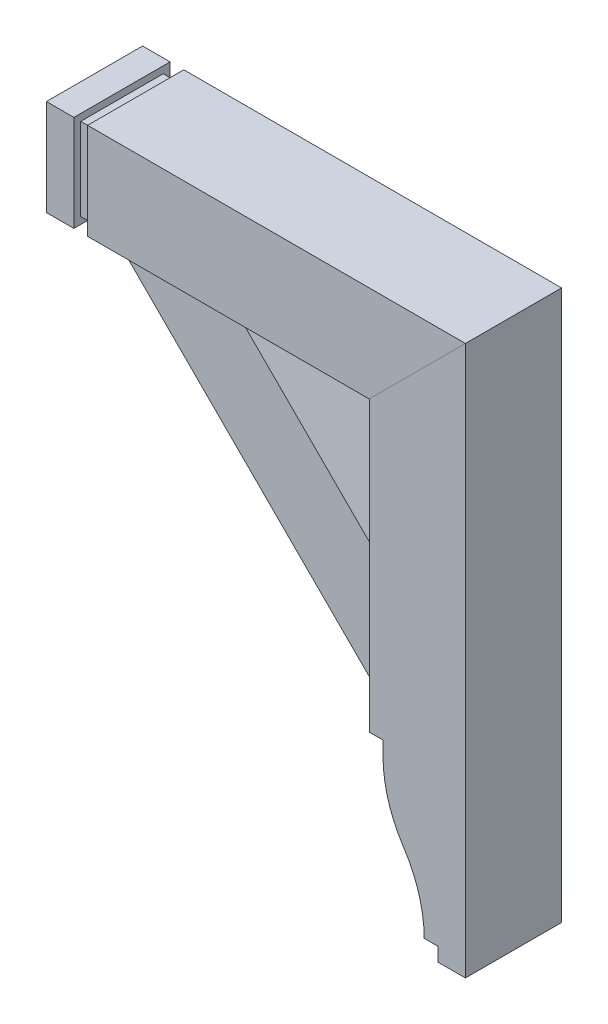
ISO-10303-21;
HEADER;
FILE_DESCRIPTION(('STEP AP214'),'2;1');
FILE_NAME('part.step','',(''),(''),'','','');
FILE_SCHEMA(('AUTOMOTIVE_DESIGN { 1 0 10303 214 1 1 1 1 }'));
ENDSEC;
DATA;
#1=APPLICATION_CONTEXT('core data for automotive mechanical design processes');
#2=APPLICATION_PROTOCOL_DEFINITION('international standard','automotive_design',2000,#1);
#3=PRODUCT_CONTEXT('',#1,'mechanical');
#4=PRODUCT('Part','Part','',(#3));
#5=PRODUCT_RELATED_PRODUCT_CATEGORY('part','',(#4));
#6=PRODUCT_DEFINITION_FORMATION('','',#4);
#7=PRODUCT_DEFINITION_CONTEXT('part definition',#1,'design');
#8=PRODUCT_DEFINITION('design','',#6,#7);
#9=PRODUCT_DEFINITION_SHAPE('','',#8);
#10=(LENGTH_UNIT() NAMED_UNIT(*) SI_UNIT(.MILLI.,.METRE.));
#11=(NAMED_UNIT(*) PLANE_ANGLE_UNIT() SI_UNIT($,.RADIAN.));
#12=(NAMED_UNIT(*) SI_UNIT($,.STERADIAN.) SOLID_ANGLE_UNIT());
#13=UNCERTAINTY_MEASURE_WITH_UNIT(LENGTH_MEASURE(1.E-05),#10,'distance_accuracy_value','');
#14=(GEOMETRIC_REPRESENTATION_CONTEXT(3) GLOBAL_UNCERTAINTY_ASSIGNED_CONTEXT((#13)) GLOBAL_UNIT_ASSIGNED_CONTEXT((#10,
#11,#12)) REPRESENTATION_CONTEXT('',''));
#15=CARTESIAN_POINT('',(0.,0.,0.));
#16=DIRECTION('',(0.,0.,1.));
#17=DIRECTION('',(1.,0.,0.));
#18=AXIS2_PLACEMENT_3D('',#15,#16,#17);
#19=CARTESIAN_POINT('',(0.,228.24431630972,44.45));
#20=DIRECTION('',(0.,1.,0.));
#21=DIRECTION('',(0.,0.,1.));
#22=AXIS2_PLACEMENT_3D('',#19,#20,#21);
#23=PLANE('',#22);
#24=DIRECTION('',(1.,0.,0.));
#25=VECTOR('',#24,1.);
#26=CARTESIAN_POINT('',(0.,228.24431630972,-44.45));
#27=LINE('',#26,#25);
#28=CARTESIAN_POINT('',(-352.423927863135,228.24431630972,-44.45));
#29=VERTEX_POINT('',#28);
#30=CARTESIAN_POINT('',(-92.0739278631353,228.24431630972,-44.45));
#31=VERTEX_POINT('',#30);
#32=EDGE_CURVE('E116',#29,#31,#27,.T.);
#33=ORIENTED_EDGE('',*,*,#32,.T.);
#34=DIRECTION('',(0.,0.,-1.));
#35=VECTOR('',#34,1.);
#36=CARTESIAN_POINT('',(-92.0739278631353,228.24431630972,44.45));
#37=LINE('',#36,#35);
#38=CARTESIAN_POINT('',(-92.0739278631353,228.24431630972,44.45));
#39=VERTEX_POINT('',#38);
#40=EDGE_CURVE('E13',#39,#31,#37,.T.);
#41=ORIENTED_EDGE('',*,*,#40,.F.);
#42=DIRECTION('',(1.,0.,0.));
#43=VECTOR('',#42,1.);
#44=CARTESIAN_POINT('',(0.,228.24431630972,44.45));
#45=LINE('',#44,#43);
#46=CARTESIAN_POINT('',(-352.423927863135,228.24431630972,44.45));
#47=VERTEX_POINT('',#46);
#48=EDGE_CURVE('E104',#47,#39,#45,.T.);
#49=ORIENTED_EDGE('',*,*,#48,.F.);
#50=DIRECTION('',(0.,0.,-1.));
#51=VECTOR('',#50,1.);
#52=CARTESIAN_POINT('',(-352.423927863135,228.24431630972,44.45));
#53=LINE('',#52,#51);
#54=EDGE_CURVE('E112',#47,#29,#53,.T.);
#55=ORIENTED_EDGE('',*,*,#54,.T.);
#56=EDGE_LOOP('',(#33,#41,#49,#55));
#57=FACE_BOUND('',#56,.T.);
#58=ADVANCED_FACE('F53',(#57),#23,.F.);
#59=CARTESIAN_POINT('',(-160.159122086428,160.159122086427,44.45));
#60=DIRECTION('',(-0.707106781186548,0.707106781186547,0.));
#61=DIRECTION('',(-0.707106781186547,-0.707106781186548,0.));
#62=AXIS2_PLACEMENT_3D('',#59,#60,#61);
#63=PLANE('',#62);
#64=DIRECTION('',(0.707106781186547,0.707106781186548,0.));
#65=VECTOR('',#64,1.);
#66=CARTESIAN_POINT('',(-160.159122086428,160.159122086427,-44.45));
#67=LINE('',#66,#65);
#68=CARTESIAN_POINT('',(-3.17392786313531,317.14431630972,-44.45));
#69=VERTEX_POINT('',#68);
#70=EDGE_CURVE('E108',#31,#69,#67,.T.);
#71=ORIENTED_EDGE('',*,*,#70,.T.);
#72=DIRECTION('',(0.,0.,-1.));
#73=VECTOR('',#72,1.);
#74=CARTESIAN_POINT('',(-3.17392786313531,317.14431630972,44.45));
#75=LINE('',#74,#73);
#76=CARTESIAN_POINT('',(-3.17392786313531,317.14431630972,44.45));
#77=VERTEX_POINT('',#76);
#78=EDGE_CURVE('E61',#77,#69,#75,.T.);
#79=ORIENTED_EDGE('',*,*,#78,.F.);
#80=DIRECTION('',(0.707106781186547,0.707106781186548,0.));
#81=VECTOR('',#80,1.);
#82=CARTESIAN_POINT('',(-160.159122086428,160.159122086427,44.45));
#83=LINE('',#82,#81);
#84=EDGE_CURVE('E99',#39,#77,#83,.T.);
#85=ORIENTED_EDGE('',*,*,#84,.F.);
#86=ORIENTED_EDGE('',*,*,#40,.T.);
#87=EDGE_LOOP('',(#71,#79,#85,#86));
#88=FACE_BOUND('',#87,.T.);
#89=ADVANCED_FACE('F107',(#88),#63,.F.);
#90=CARTESIAN_POINT('',(-1.00816298381118E-13,317.14431630972,44.45));
#91=DIRECTION('',(0.,-1.,0.));
#92=DIRECTION('',(1.,0.,0.));
#93=AXIS2_PLACEMENT_3D('',#90,#91,#92);
#94=PLANE('',#93);
#95=DIRECTION('',(-1.,0.,0.));
#96=VECTOR('',#95,1.);
#97=CARTESIAN_POINT('',(-1.00816298381118E-13,317.14431630972,-44.45));
#98=LINE('',#97,#96);
#99=CARTESIAN_POINT('',(-352.423927863135,317.14431630972,-44.45));
#100=VERTEX_POINT('',#99);
#101=EDGE_CURVE('E86',#69,#100,#98,.T.);
#102=ORIENTED_EDGE('',*,*,#101,.T.);
#103=DIRECTION('',(0.,0.,-1.));
#104=VECTOR('',#103,1.);
#105=CARTESIAN_POINT('',(-352.423927863135,317.14431630972,44.45));
#106=LINE('',#105,#104);
#107=CARTESIAN_POINT('',(-352.423927863135,317.14431630972,44.45));
#108=VERTEX_POINT('',#107);
#109=EDGE_CURVE('E109',#108,#100,#106,.T.);
#110=ORIENTED_EDGE('',*,*,#109,.F.);
#111=DIRECTION('',(-1.,0.,0.));
#112=VECTOR('',#111,1.);
#113=CARTESIAN_POINT('',(-1.00816298381118E-13,317.14431630972,44.45));
#114=LINE('',#113,#112);
#115=EDGE_CURVE('E102',#77,#108,#114,.T.);
#116=ORIENTED_EDGE('',*,*,#115,.F.);
#117=ORIENTED_EDGE('',*,*,#78,.T.);
#118=EDGE_LOOP('',(#102,#110,#116,#117));
#119=FACE_BOUND('',#118,.T.);
#120=ADVANCED_FACE('F110',(#119),#94,.F.);
#121=CARTESIAN_POINT('',(-352.423927863135,0.,44.45));
#122=DIRECTION('',(1.,0.,0.));
#123=DIRECTION('',(0.,0.,-1.));
#124=AXIS2_PLACEMENT_3D('',#121,#122,#123);
#125=PLANE('',#124);
#126=DIRECTION('',(0.,-1.,0.));
#127=VECTOR('',#126,1.);
#128=CARTESIAN_POINT('',(-352.423927863135,0.,-44.45));
#129=LINE('',#128,#127);
#130=EDGE_CURVE('E92',#100,#29,#129,.T.);
#131=ORIENTED_EDGE('',*,*,#130,.T.);
#132=ORIENTED_EDGE('',*,*,#54,.F.);
#133=DIRECTION('',(0.,-1.,0.));
#134=VECTOR('',#133,1.);
#135=CARTESIAN_POINT('',(-352.423927863135,0.,44.45));
#136=LINE('',#135,#134);
#137=EDGE_CURVE('E69',#108,#47,#136,.T.);
#138=ORIENTED_EDGE('',*,*,#137,.F.);
#139=ORIENTED_EDGE('',*,*,#109,.T.);
#140=EDGE_LOOP('',(#131,#132,#138,#139));
#141=FACE_BOUND('',#140,.T.);
#142=ADVANCED_FACE('F123',(#141),#125,.F.);
#143=CARTESIAN_POINT('',(0.,0.,44.45));
#144=DIRECTION('',(0.,0.,1.));
#145=DIRECTION('',(1.,0.,0.));
#146=AXIS2_PLACEMENT_3D('',#143,#144,#145);
#147=PLANE('',#146);
#148=ORIENTED_EDGE('',*,*,#48,.T.);
#149=ORIENTED_EDGE('',*,*,#84,.T.);
#150=ORIENTED_EDGE('',*,*,#115,.T.);
#151=ORIENTED_EDGE('',*,*,#137,.T.);
#152=EDGE_LOOP('',(#148,#149,#150,#151));
#153=FACE_BOUND('',#152,.T.);
#154=ADVANCED_FACE('F100',(#153),#147,.T.);
#155=CARTESIAN_POINT('',(0.,0.,-44.45));
#156=DIRECTION('',(0.,0.,1.));
#157=DIRECTION('',(1.,0.,0.));
#158=AXIS2_PLACEMENT_3D('',#155,#156,#157);
#159=PLANE('',#158);
#160=ORIENTED_EDGE('',*,*,#32,.F.);
#161=ORIENTED_EDGE('',*,*,#130,.F.);
#162=ORIENTED_EDGE('',*,*,#101,.F.);
#163=ORIENTED_EDGE('',*,*,#70,.F.);
#164=EDGE_LOOP('',(#160,#161,#162,#163));
#165=FACE_BOUND('',#164,.T.);
#166=ADVANCED_FACE('F126',(#165),#159,.F.);
#167=CLOSED_SHELL('',(#58,#89,#120,#142,#154,#166));
#168=MANIFOLD_SOLID_BREP('B2',#167);
#169=CARTESIAN_POINT('',(0.,310.79431630972,38.1));
#170=DIRECTION('',(0.,-1.,0.));
#171=DIRECTION('',(0.,0.,-1.));
#172=AXIS2_PLACEMENT_3D('',#169,#170,#171);
#173=PLANE('',#172);
#174=DIRECTION('',(-1.,0.,0.));
#175=VECTOR('',#174,1.);
#176=CARTESIAN_POINT('',(0.,310.79431630972,-38.1));
#177=LINE('',#176,#175);
#178=CARTESIAN_POINT('',(-352.423927863135,310.79431630972,-38.1));
#179=VERTEX_POINT('',#178);
#180=CARTESIAN_POINT('',(-365.123927863135,310.79431630972,-38.1));
#181=VERTEX_POINT('',#180);
#182=EDGE_CURVE('E310',#179,#181,#177,.T.);
#183=ORIENTED_EDGE('',*,*,#182,.T.);
#184=DIRECTION('',(0.,0.,-1.));
#185=VECTOR('',#184,1.);
#186=CARTESIAN_POINT('',(-365.123927863135,310.79431630972,38.1));
#187=LINE('',#186,#185);
#188=CARTESIAN_POINT('',(-365.123927863135,310.79431630972,38.1));
#189=VERTEX_POINT('',#188);
#190=EDGE_CURVE('E51',#189,#181,#187,.T.);
#191=ORIENTED_EDGE('',*,*,#190,.F.);
#192=DIRECTION('',(-1.,0.,0.));
#193=VECTOR('',#192,1.);
#194=CARTESIAN_POINT('',(0.,310.79431630972,38.1));
#195=LINE('',#194,#193);
#196=CARTESIAN_POINT('',(-352.423927863135,310.79431630972,38.1));
#197=VERTEX_POINT('',#196);
#198=EDGE_CURVE('E272',#197,#189,#195,.T.);
#199=ORIENTED_EDGE('',*,*,#198,.F.);
#200=DIRECTION('',(0.,0.,-1.));
#201=VECTOR('',#200,1.);
#202=CARTESIAN_POINT('',(-352.423927863135,310.79431630972,38.1));
#203=LINE('',#202,#201);
#204=EDGE_CURVE('E213',#197,#179,#203,.T.);
#205=ORIENTED_EDGE('',*,*,#204,.T.);
#206=EDGE_LOOP('',(#183,#191,#199,#205));
#207=FACE_BOUND('',#206,.T.);
#208=ADVANCED_FACE('F195',(#207),#173,.F.);
#209=CARTESIAN_POINT('',(0.,234.59431630972,38.1));
#210=DIRECTION('',(0.,-1.,0.));
#211=DIRECTION('',(0.,0.,-1.));
#212=AXIS2_PLACEMENT_3D('',#209,#210,#211);
#213=PLANE('',#212);
#214=DIRECTION('',(-1.,0.,0.));
#215=VECTOR('',#214,1.);
#216=CARTESIAN_POINT('',(0.,234.59431630972,-38.1));
#217=LINE('',#216,#215);
#218=CARTESIAN_POINT('',(-352.423927863135,234.59431630972,-38.1));
#219=VERTEX_POINT('',#218);
#220=CARTESIAN_POINT('',(-365.123927863135,234.59431630972,-38.1));
#221=VERTEX_POINT('',#220);
#222=EDGE_CURVE('E329',#219,#221,#217,.T.);
#223=ORIENTED_EDGE('',*,*,#222,.F.);
#224=DIRECTION('',(0.,0.,-1.));
#225=VECTOR('',#224,1.);
#226=CARTESIAN_POINT('',(-352.423927863135,234.59431630972,38.1));
#227=LINE('',#226,#225);
#228=CARTESIAN_POINT('',(-352.423927863135,234.59431630972,38.1));
#229=VERTEX_POINT('',#228);
#230=EDGE_CURVE('E281',#229,#219,#227,.T.);
#231=ORIENTED_EDGE('',*,*,#230,.F.);
#232=DIRECTION('',(-1.,0.,0.));
#233=VECTOR('',#232,1.);
#234=CARTESIAN_POINT('',(0.,234.59431630972,38.1));
#235=LINE('',#234,#233);
#236=CARTESIAN_POINT('',(-365.123927863135,234.59431630972,38.1));
#237=VERTEX_POINT('',#236);
#238=EDGE_CURVE('E271',#229,#237,#235,.T.);
#239=ORIENTED_EDGE('',*,*,#238,.T.);
#240=DIRECTION('',(0.,0.,-1.));
#241=VECTOR('',#240,1.);
#242=CARTESIAN_POINT('',(-365.123927863135,234.59431630972,38.1));
#243=LINE('',#242,#241);
#244=EDGE_CURVE('E204',#237,#221,#243,.T.);
#245=ORIENTED_EDGE('',*,*,#244,.T.);
#246=EDGE_LOOP('',(#223,#231,#239,#245));
#247=FACE_BOUND('',#246,.T.);
#248=ADVANCED_FACE('F279',(#247),#213,.T.);
#249=CARTESIAN_POINT('',(-352.423927863135,0.,38.1));
#250=DIRECTION('',(1.,0.,0.));
#251=DIRECTION('',(0.,0.,-1.));
#252=AXIS2_PLACEMENT_3D('',#249,#250,#251);
#253=PLANE('',#252);
#254=DIRECTION('',(0.,-1.,0.));
#255=VECTOR('',#254,1.);
#256=CARTESIAN_POINT('',(-352.423927863135,0.,-38.1));
#257=LINE('',#256,#255);
#258=EDGE_CURVE('E325',#179,#219,#257,.T.);
#259=ORIENTED_EDGE('',*,*,#258,.F.);
#260=ORIENTED_EDGE('',*,*,#204,.F.);
#261=DIRECTION('',(0.,-1.,0.));
#262=VECTOR('',#261,1.);
#263=CARTESIAN_POINT('',(-352.423927863135,0.,38.1));
#264=LINE('',#263,#262);
#265=EDGE_CURVE('E282',#197,#229,#264,.T.);
#266=ORIENTED_EDGE('',*,*,#265,.T.);
#267=ORIENTED_EDGE('',*,*,#230,.T.);
#268=EDGE_LOOP('',(#259,#260,#266,#267));
#269=FACE_BOUND('',#268,.T.);
#270=ADVANCED_FACE('F336',(#269),#253,.T.);
#271=CARTESIAN_POINT('',(0.,0.,38.1));
#272=DIRECTION('',(0.,0.,1.));
#273=DIRECTION('',(1.,0.,0.));
#274=AXIS2_PLACEMENT_3D('',#271,#272,#273);
#275=PLANE('',#274);
#276=ORIENTED_EDGE('',*,*,#198,.T.);
#277=DIRECTION('',(0.,-1.,0.));
#278=VECTOR('',#277,1.);
#279=CARTESIAN_POINT('',(-365.123927863135,0.,38.1));
#280=LINE('',#279,#278);
#281=EDGE_CURVE('E267',#189,#237,#280,.T.);
#282=ORIENTED_EDGE('',*,*,#281,.T.);
#283=ORIENTED_EDGE('',*,*,#238,.F.);
#284=ORIENTED_EDGE('',*,*,#265,.F.);
#285=EDGE_LOOP('',(#276,#282,#283,#284));
#286=FACE_BOUND('',#285,.T.);
#287=ADVANCED_FACE('F269',(#286),#275,.T.);
#288=CARTESIAN_POINT('',(0.,0.,-38.1));
#289=DIRECTION('',(0.,0.,1.));
#290=DIRECTION('',(1.,0.,0.));
#291=AXIS2_PLACEMENT_3D('',#288,#289,#290);
#292=PLANE('',#291);
#293=ORIENTED_EDGE('',*,*,#182,.F.);
#294=ORIENTED_EDGE('',*,*,#258,.T.);
#295=ORIENTED_EDGE('',*,*,#222,.T.);
#296=DIRECTION('',(0.,-1.,0.));
#297=VECTOR('',#296,1.);
#298=CARTESIAN_POINT('',(-365.123927863135,0.,-38.1));
#299=LINE('',#298,#297);
#300=EDGE_CURVE('E288',#181,#221,#299,.T.);
#301=ORIENTED_EDGE('',*,*,#300,.F.);
#302=EDGE_LOOP('',(#293,#294,#295,#301));
#303=FACE_BOUND('',#302,.T.);
#304=ADVANCED_FACE('F335',(#303),#292,.F.);
#305=CARTESIAN_POINT('',(-6.93112051370188E-13,317.144316309721,44.45));
#306=DIRECTION('',(0.,-1.,0.));
#307=DIRECTION('',(1.,0.,0.));
#308=AXIS2_PLACEMENT_3D('',#305,#306,#307);
#309=PLANE('',#308);
#310=DIRECTION('',(-1.,0.,0.));
#311=VECTOR('',#310,1.);
#312=CARTESIAN_POINT('',(-6.93112051370188E-13,317.144316309721,-44.45));
#313=LINE('',#312,#311);
#314=CARTESIAN_POINT('',(-365.123927863135,317.14431630972,-44.45));
#315=VERTEX_POINT('',#314);
#316=CARTESIAN_POINT('',(-390.523927863135,317.14431630972,-44.45));
#317=VERTEX_POINT('',#316);
#318=EDGE_CURVE('E293',#315,#317,#313,.T.);
#319=ORIENTED_EDGE('',*,*,#318,.T.);
#320=DIRECTION('',(0.,0.,1.));
#321=VECTOR('',#320,1.);
#322=CARTESIAN_POINT('',(-390.523927863135,317.14431630972,0.));
#323=LINE('',#322,#321);
#324=CARTESIAN_POINT('',(-390.523927863135,317.14431630972,44.45));
#325=VERTEX_POINT('',#324);
#326=EDGE_CURVE('E308',#325,#317,#323,.F.);
#327=ORIENTED_EDGE('',*,*,#326,.F.);
#328=DIRECTION('',(-1.,0.,0.));
#329=VECTOR('',#328,1.);
#330=CARTESIAN_POINT('',(-6.93112051370188E-13,317.144316309721,44.45));
#331=LINE('',#330,#329);
#332=CARTESIAN_POINT('',(-365.123927863135,317.14431630972,44.45));
#333=VERTEX_POINT('',#332);
#334=EDGE_CURVE('E297',#333,#325,#331,.T.);
#335=ORIENTED_EDGE('',*,*,#334,.F.);
#336=DIRECTION('',(0.,0.,-1.));
#337=VECTOR('',#336,1.);
#338=CARTESIAN_POINT('',(-365.123927863135,317.14431630972,44.45));
#339=LINE('',#338,#337);
#340=EDGE_CURVE('E318',#333,#315,#339,.T.);
#341=ORIENTED_EDGE('',*,*,#340,.T.);
#342=EDGE_LOOP('',(#319,#327,#335,#341));
#343=FACE_BOUND('',#342,.T.);
#344=ADVANCED_FACE('F369',(#343),#309,.F.);
#345=CARTESIAN_POINT('',(-4.98823022060786E-13,228.244316309721,44.45));
#346=DIRECTION('',(0.,-1.,0.));
#347=DIRECTION('',(1.,0.,0.));
#348=AXIS2_PLACEMENT_3D('',#345,#346,#347);
#349=PLANE('',#348);
#350=DIRECTION('',(-1.,0.,0.));
#351=VECTOR('',#350,1.);
#352=CARTESIAN_POINT('',(-4.98823022060786E-13,228.244316309721,-44.45));
#353=LINE('',#352,#351);
#354=CARTESIAN_POINT('',(-365.123927863135,228.24431630972,-44.45));
#355=VERTEX_POINT('',#354);
#356=CARTESIAN_POINT('',(-390.523927863135,228.24431630972,-44.45));
#357=VERTEX_POINT('',#356);
#358=EDGE_CURVE('E303',#355,#357,#353,.T.);
#359=ORIENTED_EDGE('',*,*,#358,.F.);
#360=DIRECTION('',(0.,0.,-1.));
#361=VECTOR('',#360,1.);
#362=CARTESIAN_POINT('',(-365.123927863135,228.24431630972,44.45));
#363=LINE('',#362,#361);
#364=CARTESIAN_POINT('',(-365.123927863135,228.24431630972,44.45));
#365=VERTEX_POINT('',#364);
#366=EDGE_CURVE('E251',#365,#355,#363,.T.);
#367=ORIENTED_EDGE('',*,*,#366,.F.);
#368=DIRECTION('',(-1.,0.,0.));
#369=VECTOR('',#368,1.);
#370=CARTESIAN_POINT('',(-4.98823022060786E-13,228.244316309721,44.45));
#371=LINE('',#370,#369);
#372=CARTESIAN_POINT('',(-390.523927863135,228.24431630972,44.45));
#373=VERTEX_POINT('',#372);
#374=EDGE_CURVE('E300',#365,#373,#371,.T.);
#375=ORIENTED_EDGE('',*,*,#374,.T.);
#376=DIRECTION('',(0.,0.,1.));
#377=VECTOR('',#376,1.);
#378=CARTESIAN_POINT('',(-390.523927863135,228.24431630972,44.45));
#379=LINE('',#378,#377);
#380=EDGE_CURVE('E198',#373,#357,#379,.F.);
#381=ORIENTED_EDGE('',*,*,#380,.T.);
#382=EDGE_LOOP('',(#359,#367,#375,#381));
#383=FACE_BOUND('',#382,.T.);
#384=ADVANCED_FACE('F380',(#383),#349,.T.);
#385=CARTESIAN_POINT('',(-365.123927863135,0.,44.45));
#386=DIRECTION('',(1.,0.,0.));
#387=DIRECTION('',(0.,0.,-1.));
#388=AXIS2_PLACEMENT_3D('',#385,#386,#387);
#389=PLANE('',#388);
#390=ORIENTED_EDGE('',*,*,#190,.T.);
#391=ORIENTED_EDGE('',*,*,#300,.T.);
#392=ORIENTED_EDGE('',*,*,#244,.F.);
#393=ORIENTED_EDGE('',*,*,#281,.F.);
#394=EDGE_LOOP('',(#390,#391,#392,#393));
#395=FACE_BOUND('',#394,.T.);
#396=DIRECTION('',(0.,-1.,0.));
#397=VECTOR('',#396,1.);
#398=CARTESIAN_POINT('',(-365.123927863135,0.,-44.45));
#399=LINE('',#398,#397);
#400=EDGE_CURVE('E299',#315,#355,#399,.T.);
#401=ORIENTED_EDGE('',*,*,#400,.F.);
#402=ORIENTED_EDGE('',*,*,#340,.F.);
#403=DIRECTION('',(0.,-1.,0.));
#404=VECTOR('',#403,1.);
#405=CARTESIAN_POINT('',(-365.123927863135,0.,44.45));
#406=LINE('',#405,#404);
#407=EDGE_CURVE('E302',#333,#365,#406,.T.);
#408=ORIENTED_EDGE('',*,*,#407,.T.);
#409=ORIENTED_EDGE('',*,*,#366,.T.);
#410=EDGE_LOOP('',(#401,#402,#408,#409));
#411=FACE_BOUND('',#410,.T.);
#412=ADVANCED_FACE('F285',(#395,#411),#389,.T.);
#413=CARTESIAN_POINT('',(0.,0.,44.45));
#414=DIRECTION('',(0.,0.,1.));
#415=DIRECTION('',(1.,0.,0.));
#416=AXIS2_PLACEMENT_3D('',#413,#414,#415);
#417=PLANE('',#416);
#418=ORIENTED_EDGE('',*,*,#334,.T.);
#419=DIRECTION('',(0.,1.,0.));
#420=VECTOR('',#419,1.);
#421=CARTESIAN_POINT('',(-390.523927863135,0.,44.45));
#422=LINE('',#421,#420);
#423=EDGE_CURVE('E243',#325,#373,#422,.F.);
#424=ORIENTED_EDGE('',*,*,#423,.T.);
#425=ORIENTED_EDGE('',*,*,#374,.F.);
#426=ORIENTED_EDGE('',*,*,#407,.F.);
#427=EDGE_LOOP('',(#418,#424,#425,#426));
#428=FACE_BOUND('',#427,.T.);
#429=ADVANCED_FACE('F379',(#428),#417,.T.);
#430=CARTESIAN_POINT('',(0.,0.,-44.45));
#431=DIRECTION('',(0.,0.,1.));
#432=DIRECTION('',(1.,0.,0.));
#433=AXIS2_PLACEMENT_3D('',#430,#431,#432);
#434=PLANE('',#433);
#435=ORIENTED_EDGE('',*,*,#318,.F.);
#436=ORIENTED_EDGE('',*,*,#400,.T.);
#437=ORIENTED_EDGE('',*,*,#358,.T.);
#438=DIRECTION('',(0.,1.,0.));
#439=VECTOR('',#438,1.);
#440=CARTESIAN_POINT('',(-390.523927863135,0.,-44.45));
#441=LINE('',#440,#439);
#442=EDGE_CURVE('E295',#317,#357,#441,.F.);
#443=ORIENTED_EDGE('',*,*,#442,.F.);
#444=EDGE_LOOP('',(#435,#436,#437,#443));
#445=FACE_BOUND('',#444,.T.);
#446=ADVANCED_FACE('F405',(#445),#434,.F.);
#447=CARTESIAN_POINT('',(-353.834122086427,353.834122086428,0.));
#448=DIRECTION('',(0.707106781186547,-0.707106781186548,0.));
#449=DIRECTION('',(0.707106781186548,0.707106781186547,0.));
#450=AXIS2_PLACEMENT_3D('',#447,#448,#449);
#451=PLANE('',#450);
#452=DIRECTION('',(-0.577350269189626,-0.577350269189625,0.577350269189626));
#453=VECTOR('',#452,1.);
#454=CARTESIAN_POINT('',(-390.523927863135,317.14431630972,-44.45));
#455=LINE('',#454,#453);
#456=CARTESIAN_POINT('',(-434.973927863135,272.69431630972,0.));
#457=VERTEX_POINT('',#456);
#458=EDGE_CURVE('E474',#317,#457,#455,.T.);
#459=ORIENTED_EDGE('',*,*,#458,.T.);
#460=DIRECTION('',(-0.577350269189626,-0.577350269189625,-0.577350269189626));
#461=VECTOR('',#460,1.);
#462=CARTESIAN_POINT('',(-390.523927863135,317.14431630972,44.45));
#463=LINE('',#462,#461);
#464=EDGE_CURVE('E464',#325,#457,#463,.T.);
#465=ORIENTED_EDGE('',*,*,#464,.F.);
#466=ORIENTED_EDGE('',*,*,#326,.T.);
#467=EDGE_LOOP('',(#459,#465,#466));
#468=FACE_BOUND('',#467,.T.);
#469=ADVANCED_FACE('F414',(#468),#451,.F.);
#470=CARTESIAN_POINT('',(-217.486963931568,0.,217.486963931568));
#471=DIRECTION('',(0.707106781186548,0.,-0.707106781186548));
#472=DIRECTION('',(-0.707106781186548,0.,-0.707106781186548));
#473=AXIS2_PLACEMENT_3D('',#470,#471,#472);
#474=PLANE('',#473);
#475=ORIENTED_EDGE('',*,*,#464,.T.);
#476=DIRECTION('',(-0.577350269189626,0.577350269189626,-0.577350269189626));
#477=VECTOR('',#476,1.);
#478=CARTESIAN_POINT('',(-390.523927863135,228.24431630972,44.45));
#479=LINE('',#478,#477);
#480=EDGE_CURVE('E296',#373,#457,#479,.T.);
#481=ORIENTED_EDGE('',*,*,#480,.F.);
#482=ORIENTED_EDGE('',*,*,#423,.F.);
#483=EDGE_LOOP('',(#475,#481,#482));
#484=FACE_BOUND('',#483,.T.);
#485=ADVANCED_FACE('F424',(#484),#474,.F.);
#486=CARTESIAN_POINT('',(-217.486963931568,0.,-217.486963931568));
#487=DIRECTION('',(0.707106781186548,0.,0.707106781186548));
#488=DIRECTION('',(0.707106781186548,0.,-0.707106781186548));
#489=AXIS2_PLACEMENT_3D('',#486,#487,#488);
#490=PLANE('',#489);
#491=DIRECTION('',(-0.577350269189626,0.577350269189626,0.577350269189626));
#492=VECTOR('',#491,1.);
#493=CARTESIAN_POINT('',(-390.523927863135,228.24431630972,-44.45));
#494=LINE('',#493,#492);
#495=EDGE_CURVE('E461',#357,#457,#494,.T.);
#496=ORIENTED_EDGE('',*,*,#495,.T.);
#497=ORIENTED_EDGE('',*,*,#458,.F.);
#498=ORIENTED_EDGE('',*,*,#442,.T.);
#499=EDGE_LOOP('',(#496,#497,#498));
#500=FACE_BOUND('',#499,.T.);
#501=ADVANCED_FACE('F433',(#500),#490,.F.);
#502=CARTESIAN_POINT('',(-81.139805776708,-81.1398057767079,0.));
#503=DIRECTION('',(0.707106781186548,0.707106781186547,0.));
#504=DIRECTION('',(-0.707106781186547,0.707106781186548,0.));
#505=AXIS2_PLACEMENT_3D('',#502,#503,#504);
#506=PLANE('',#505);
#507=ORIENTED_EDGE('',*,*,#480,.T.);
#508=ORIENTED_EDGE('',*,*,#495,.F.);
#509=ORIENTED_EDGE('',*,*,#380,.F.);
#510=EDGE_LOOP('',(#507,#508,#509));
#511=FACE_BOUND('',#510,.T.);
#512=ADVANCED_FACE('F443',(#511),#506,.F.);
#513=CLOSED_SHELL('',(#208,#248,#270,#287,#304,#344,#384,#412,#429,#446,#469,#485,#501,#512));
#514=MANIFOLD_SOLID_BREP('B7',#513);
#515=CARTESIAN_POINT('',(-1.76480577670773,-1.76480577670773,31.75));
#516=DIRECTION('',(0.707106781186548,0.707106781186548,0.));
#517=DIRECTION('',(-0.707106781186548,0.707106781186548,0.));
#518=AXIS2_PLACEMENT_3D('',#515,#516,#517);
#519=PLANE('',#518);
#520=DIRECTION('',(0.707106781186548,-0.707106781186548,0.));
#521=VECTOR('',#520,1.);
#522=CARTESIAN_POINT('',(-1.76480577670773,-1.76480577670773,-31.75));
#523=LINE('',#522,#521);
#524=CARTESIAN_POINT('',(-231.773927863135,228.24431630972,-31.75));
#525=VERTEX_POINT('',#524);
#526=CARTESIAN_POINT('',(-92.0739278631353,88.5443163097198,-31.75));
#527=VERTEX_POINT('',#526);
#528=EDGE_CURVE('E578',#525,#527,#523,.T.);
#529=ORIENTED_EDGE('',*,*,#528,.F.);
#530=DIRECTION('',(0.,0.,-1.));
#531=VECTOR('',#530,1.);
#532=CARTESIAN_POINT('',(-231.773927863135,228.24431630972,31.75));
#533=LINE('',#532,#531);
#534=CARTESIAN_POINT('',(-231.773927863135,228.24431630972,31.75));
#535=VERTEX_POINT('',#534);
#536=EDGE_CURVE('E193',#535,#525,#533,.T.);
#537=ORIENTED_EDGE('',*,*,#536,.F.);
#538=DIRECTION('',(0.707106781186548,-0.707106781186548,0.));
#539=VECTOR('',#538,1.);
#540=CARTESIAN_POINT('',(-1.76480577670773,-1.76480577670773,31.75));
#541=LINE('',#540,#539);
#542=CARTESIAN_POINT('',(-92.0739278631353,88.5443163097198,31.75));
#543=VERTEX_POINT('',#542);
#544=EDGE_CURVE('E591',#535,#543,#541,.T.);
#545=ORIENTED_EDGE('',*,*,#544,.T.);
#546=DIRECTION('',(0.,0.,-1.));
#547=VECTOR('',#546,1.);
#548=CARTESIAN_POINT('',(-92.0739278631353,88.5443163097198,31.75));
#549=LINE('',#548,#547);
#550=EDGE_CURVE('E512',#543,#527,#549,.T.);
#551=ORIENTED_EDGE('',*,*,#550,.T.);
#552=EDGE_LOOP('',(#529,#537,#545,#551));
#553=FACE_BOUND('',#552,.T.);
#554=ADVANCED_FACE('F496',(#553),#519,.T.);
#555=CARTESIAN_POINT('',(0.,228.24431630972,31.75));
#556=DIRECTION('',(0.,1.,0.));
#557=DIRECTION('',(0.,0.,1.));
#558=AXIS2_PLACEMENT_3D('',#555,#556,#557);
#559=PLANE('',#558);
#560=DIRECTION('',(1.,0.,0.));
#561=VECTOR('',#560,1.);
#562=CARTESIAN_POINT('',(0.,228.24431630972,-31.75));
#563=LINE('',#562,#561);
#564=CARTESIAN_POINT('',(-327.023927863135,228.24431630972,-31.75));
#565=VERTEX_POINT('',#564);
#566=EDGE_CURVE('E580',#565,#525,#563,.T.);
#567=ORIENTED_EDGE('',*,*,#566,.F.);
#568=DIRECTION('',(0.,0.,-1.));
#569=VECTOR('',#568,1.);
#570=CARTESIAN_POINT('',(-327.023927863135,228.24431630972,31.75));
#571=LINE('',#570,#569);
#572=CARTESIAN_POINT('',(-327.023927863135,228.24431630972,31.75));
#573=VERTEX_POINT('',#572);
#574=EDGE_CURVE('E504',#573,#565,#571,.T.);
#575=ORIENTED_EDGE('',*,*,#574,.F.);
#576=DIRECTION('',(1.,0.,0.));
#577=VECTOR('',#576,1.);
#578=CARTESIAN_POINT('',(0.,228.24431630972,31.75));
#579=LINE('',#578,#577);
#580=EDGE_CURVE('E603',#573,#535,#579,.T.);
#581=ORIENTED_EDGE('',*,*,#580,.T.);
#582=ORIENTED_EDGE('',*,*,#536,.T.);
#583=EDGE_LOOP('',(#567,#575,#581,#582));
#584=FACE_BOUND('',#583,.T.);
#585=ADVANCED_FACE('F602',(#584),#559,.T.);
#586=CARTESIAN_POINT('',(-327.023927863135,0.,31.75));
#587=DIRECTION('',(1.,0.,0.));
#588=DIRECTION('',(0.,0.,-1.));
#589=AXIS2_PLACEMENT_3D('',#586,#587,#588);
#590=PLANE('',#589);
#591=DIRECTION('',(0.,-1.,0.));
#592=VECTOR('',#591,1.);
#593=CARTESIAN_POINT('',(-327.023927863135,0.,-31.75));
#594=LINE('',#593,#592);
#595=CARTESIAN_POINT('',(-327.023927863135,215.54431630972,-31.75));
#596=VERTEX_POINT('',#595);
#597=EDGE_CURVE('E583',#565,#596,#594,.T.);
#598=ORIENTED_EDGE('',*,*,#597,.T.);
#599=DIRECTION('',(0.,0.,-1.));
#600=VECTOR('',#599,1.);
#601=CARTESIAN_POINT('',(-327.023927863135,215.54431630972,31.75));
#602=LINE('',#601,#600);
#603=CARTESIAN_POINT('',(-327.023927863135,215.54431630972,31.75));
#604=VERTEX_POINT('',#603);
#605=EDGE_CURVE('E570',#604,#596,#602,.T.);
#606=ORIENTED_EDGE('',*,*,#605,.F.);
#607=DIRECTION('',(0.,-1.,0.));
#608=VECTOR('',#607,1.);
#609=CARTESIAN_POINT('',(-327.023927863135,0.,31.75));
#610=LINE('',#609,#608);
#611=EDGE_CURVE('E558',#573,#604,#610,.T.);
#612=ORIENTED_EDGE('',*,*,#611,.F.);
#613=ORIENTED_EDGE('',*,*,#574,.T.);
#614=EDGE_LOOP('',(#598,#606,#612,#613));
#615=FACE_BOUND('',#614,.T.);
#616=ADVANCED_FACE('F596',(#615),#590,.F.);
#617=CARTESIAN_POINT('',(-55.7398057767077,-55.7398057767077,31.75));
#618=DIRECTION('',(0.707106781186547,0.707106781186548,0.));
#619=DIRECTION('',(-0.707106781186548,0.707106781186547,0.));
#620=AXIS2_PLACEMENT_3D('',#617,#618,#619);
#621=PLANE('',#620);
#622=DIRECTION('',(0.707106781186548,-0.707106781186547,0.));
#623=VECTOR('',#622,1.);
#624=CARTESIAN_POINT('',(-55.7398057767077,-55.7398057767077,-31.75));
#625=LINE('',#624,#623);
#626=CARTESIAN_POINT('',(-104.773927863135,-6.70568369028011,-31.75));
#627=VERTEX_POINT('',#626);
#628=EDGE_CURVE('E567',#596,#627,#625,.T.);
#629=ORIENTED_EDGE('',*,*,#628,.T.);
#630=DIRECTION('',(0.,0.,-1.));
#631=VECTOR('',#630,1.);
#632=CARTESIAN_POINT('',(-104.773927863135,-6.70568369028011,31.75));
#633=LINE('',#632,#631);
#634=CARTESIAN_POINT('',(-104.773927863135,-6.70568369028011,31.75));
#635=VERTEX_POINT('',#634);
#636=EDGE_CURVE('E564',#635,#627,#633,.T.);
#637=ORIENTED_EDGE('',*,*,#636,.F.);
#638=DIRECTION('',(0.707106781186548,-0.707106781186547,0.));
#639=VECTOR('',#638,1.);
#640=CARTESIAN_POINT('',(-55.7398057767077,-55.7398057767077,31.75));
#641=LINE('',#640,#639);
#642=EDGE_CURVE('E550',#604,#635,#641,.T.);
#643=ORIENTED_EDGE('',*,*,#642,.F.);
#644=ORIENTED_EDGE('',*,*,#605,.T.);
#645=EDGE_LOOP('',(#629,#637,#643,#644));
#646=FACE_BOUND('',#645,.T.);
#647=ADVANCED_FACE('F565',(#646),#621,.F.);
#648=CARTESIAN_POINT('',(0.,-6.7056836902801,31.75));
#649=DIRECTION('',(0.,-1.,0.));
#650=DIRECTION('',(1.,0.,0.));
#651=AXIS2_PLACEMENT_3D('',#648,#649,#650);
#652=PLANE('',#651);
#653=DIRECTION('',(-1.,0.,0.));
#654=VECTOR('',#653,1.);
#655=CARTESIAN_POINT('',(0.,-6.7056836902801,-31.75));
#656=LINE('',#655,#654);
#657=CARTESIAN_POINT('',(-92.0739278631353,-6.70568369028011,-31.75));
#658=VERTEX_POINT('',#657);
#659=EDGE_CURVE('E586',#658,#627,#656,.T.);
#660=ORIENTED_EDGE('',*,*,#659,.F.);
#661=DIRECTION('',(0.,0.,-1.));
#662=VECTOR('',#661,1.);
#663=CARTESIAN_POINT('',(-92.0739278631353,-6.70568369028011,31.75));
#664=LINE('',#663,#662);
#665=CARTESIAN_POINT('',(-92.0739278631353,-6.70568369028011,31.75));
#666=VERTEX_POINT('',#665);
#667=EDGE_CURVE('E531',#666,#658,#664,.T.);
#668=ORIENTED_EDGE('',*,*,#667,.F.);
#669=DIRECTION('',(-1.,0.,0.));
#670=VECTOR('',#669,1.);
#671=CARTESIAN_POINT('',(0.,-6.7056836902801,31.75));
#672=LINE('',#671,#670);
#673=EDGE_CURVE('E555',#666,#635,#672,.T.);
#674=ORIENTED_EDGE('',*,*,#673,.T.);
#675=ORIENTED_EDGE('',*,*,#636,.T.);
#676=EDGE_LOOP('',(#660,#668,#674,#675));
#677=FACE_BOUND('',#676,.T.);
#678=ADVANCED_FACE('F572',(#677),#652,.T.);
#679=CARTESIAN_POINT('',(-92.0739278631353,0.,31.75));
#680=DIRECTION('',(1.,0.,0.));
#681=DIRECTION('',(0.,1.,0.));
#682=AXIS2_PLACEMENT_3D('',#679,#680,#681);
#683=PLANE('',#682);
#684=DIRECTION('',(0.,-1.,0.));
#685=VECTOR('',#684,1.);
#686=CARTESIAN_POINT('',(-92.0739278631353,0.,-31.75));
#687=LINE('',#686,#685);
#688=EDGE_CURVE('E588',#527,#658,#687,.T.);
#689=ORIENTED_EDGE('',*,*,#688,.F.);
#690=ORIENTED_EDGE('',*,*,#550,.F.);
#691=DIRECTION('',(0.,-1.,0.));
#692=VECTOR('',#691,1.);
#693=CARTESIAN_POINT('',(-92.0739278631353,0.,31.75));
#694=LINE('',#693,#692);
#695=EDGE_CURVE('E573',#543,#666,#694,.T.);
#696=ORIENTED_EDGE('',*,*,#695,.T.);
#697=ORIENTED_EDGE('',*,*,#667,.T.);
#698=EDGE_LOOP('',(#689,#690,#696,#697));
#699=FACE_BOUND('',#698,.T.);
#700=ADVANCED_FACE('F604',(#699),#683,.T.);
#701=CARTESIAN_POINT('',(0.,0.,31.75));
#702=DIRECTION('',(0.,0.,1.));
#703=DIRECTION('',(1.,0.,0.));
#704=AXIS2_PLACEMENT_3D('',#701,#702,#703);
#705=PLANE('',#704);
#706=ORIENTED_EDGE('',*,*,#544,.F.);
#707=ORIENTED_EDGE('',*,*,#580,.F.);
#708=ORIENTED_EDGE('',*,*,#611,.T.);
#709=ORIENTED_EDGE('',*,*,#642,.T.);
#710=ORIENTED_EDGE('',*,*,#673,.F.);
#711=ORIENTED_EDGE('',*,*,#695,.F.);
#712=EDGE_LOOP('',(#706,#707,#708,#709,#710,#711));
#713=FACE_BOUND('',#712,.T.);
#714=ADVANCED_FACE('F552',(#713),#705,.T.);
#715=CARTESIAN_POINT('',(0.,0.,-31.75));
#716=DIRECTION('',(0.,0.,1.));
#717=DIRECTION('',(1.,0.,0.));
#718=AXIS2_PLACEMENT_3D('',#715,#716,#717);
#719=PLANE('',#718);
#720=ORIENTED_EDGE('',*,*,#528,.T.);
#721=ORIENTED_EDGE('',*,*,#688,.T.);
#722=ORIENTED_EDGE('',*,*,#659,.T.);
#723=ORIENTED_EDGE('',*,*,#628,.F.);
#724=ORIENTED_EDGE('',*,*,#597,.F.);
#725=ORIENTED_EDGE('',*,*,#566,.T.);
#726=EDGE_LOOP('',(#720,#721,#722,#723,#724,#725));
#727=FACE_BOUND('',#726,.T.);
#728=ADVANCED_FACE('F601',(#727),#719,.F.);
#729=CLOSED_SHELL('',(#554,#585,#616,#647,#678,#700,#714,#728));
#730=MANIFOLD_SOLID_BREP('B45',#729);
#731=CARTESIAN_POINT('',(36.5135721368647,-51.1556836902801,44.45));
#732=DIRECTION('',(0.,0.,-1.));
#733=DIRECTION('',(-1.,0.,0.));
#734=AXIS2_PLACEMENT_3D('',#731,#732,#733);
#735=CYLINDRICAL_SURFACE('',#734,115.8875);
#736=CARTESIAN_POINT('',(36.5135721368647,-51.1556836902801,-44.45));
#737=DIRECTION('',(0.,0.,1.));
#738=DIRECTION('',(1.,0.,0.));
#739=AXIS2_PLACEMENT_3D('',#736,#737,#738);
#740=CIRCLE('',#739,115.8875);
#741=CARTESIAN_POINT('',(-79.3739278631353,-51.1556836902801,-44.45));
#742=VERTEX_POINT('',#741);
#743=CARTESIAN_POINT('',(-60.3237100312791,-114.814567112292,-44.45));
#744=VERTEX_POINT('',#743);
#745=EDGE_CURVE('E784',#742,#744,#740,.T.);
#746=ORIENTED_EDGE('',*,*,#745,.T.);
#747=DIRECTION('',(0.,0.,-1.));
#748=VECTOR('',#747,1.);
#749=CARTESIAN_POINT('',(-60.3237100312791,-114.814567112292,44.45));
#750=LINE('',#749,#748);
#751=CARTESIAN_POINT('',(-60.3237100312791,-114.814567112292,44.45));
#752=VERTEX_POINT('',#751);
#753=EDGE_CURVE('E494',#752,#744,#750,.T.);
#754=ORIENTED_EDGE('',*,*,#753,.F.);
#755=CARTESIAN_POINT('',(36.5135721368647,-51.1556836902801,44.45));
#756=DIRECTION('',(0.,0.,1.));
#757=DIRECTION('',(1.,0.,0.));
#758=AXIS2_PLACEMENT_3D('',#755,#756,#757);
#759=CIRCLE('',#758,115.8875);
#760=CARTESIAN_POINT('',(-79.3739278631353,-51.1556836902801,44.45));
#761=VERTEX_POINT('',#760);
#762=EDGE_CURVE('E807',#761,#752,#759,.T.);
#763=ORIENTED_EDGE('',*,*,#762,.F.);
#764=DIRECTION('',(0.,0.,-1.));
#765=VECTOR('',#764,1.);
#766=CARTESIAN_POINT('',(-79.3739278631353,-51.1556836902801,44.45));
#767=LINE('',#766,#765);
#768=EDGE_CURVE('E780',#761,#742,#767,.T.);
#769=ORIENTED_EDGE('',*,*,#768,.T.);
#770=EDGE_LOOP('',(#746,#754,#763,#769));
#771=FACE_BOUND('',#770,.T.);
#772=ADVANCED_FACE('F677',(#771),#735,.T.);
#773=CARTESIAN_POINT('',(-157.160992199423,-178.473450534304,44.45));
#774=DIRECTION('',(0.,0.,-1.));
#775=DIRECTION('',(-1.,0.,0.));
#776=AXIS2_PLACEMENT_3D('',#773,#774,#775);
#777=CYLINDRICAL_SURFACE('',#776,115.8875);
#778=CARTESIAN_POINT('',(-157.160992199423,-178.473450534304,-44.45));
#779=DIRECTION('',(0.,0.,1.));
#780=DIRECTION('',(1.,0.,0.));
#781=AXIS2_PLACEMENT_3D('',#778,#779,#780);
#782=CIRCLE('',#781,115.8875);
#783=CARTESIAN_POINT('',(-41.2739278631353,-178.15568369028,-44.45));
#784=VERTEX_POINT('',#783);
#785=EDGE_CURVE('E787',#744,#784,#782,.F.);
#786=ORIENTED_EDGE('',*,*,#785,.T.);
#787=DIRECTION('',(0.,0.,-1.));
#788=VECTOR('',#787,1.);
#789=CARTESIAN_POINT('',(-41.2739278631353,-178.15568369028,44.45));
#790=LINE('',#789,#788);
#791=CARTESIAN_POINT('',(-41.2739278631353,-178.15568369028,44.45));
#792=VERTEX_POINT('',#791);
#793=EDGE_CURVE('E685',#792,#784,#790,.T.);
#794=ORIENTED_EDGE('',*,*,#793,.F.);
#795=CARTESIAN_POINT('',(-157.160992199423,-178.473450534304,44.45));
#796=DIRECTION('',(0.,0.,1.));
#797=DIRECTION('',(1.,0.,0.));
#798=AXIS2_PLACEMENT_3D('',#795,#796,#797);
#799=CIRCLE('',#798,115.8875);
#800=EDGE_CURVE('E742',#752,#792,#799,.F.);
#801=ORIENTED_EDGE('',*,*,#800,.F.);
#802=ORIENTED_EDGE('',*,*,#753,.T.);
#803=EDGE_LOOP('',(#786,#794,#801,#802));
#804=FACE_BOUND('',#803,.T.);
#805=ADVANCED_FACE('F825',(#804),#777,.F.);
#806=CARTESIAN_POINT('',(-3.89355397639342E-13,-178.15568369028,44.45));
#807=DIRECTION('',(0.,-1.,0.));
#808=DIRECTION('',(1.,0.,0.));
#809=AXIS2_PLACEMENT_3D('',#806,#807,#808);
#810=PLANE('',#809);
#811=DIRECTION('',(-1.,0.,0.));
#812=VECTOR('',#811,1.);
#813=CARTESIAN_POINT('',(-3.89355397639342E-13,-178.15568369028,-44.45));
#814=LINE('',#813,#812);
#815=CARTESIAN_POINT('',(-28.5739278631353,-178.15568369028,-44.45));
#816=VERTEX_POINT('',#815);
#817=EDGE_CURVE('E790',#816,#784,#814,.T.);
#818=ORIENTED_EDGE('',*,*,#817,.F.);
#819=DIRECTION('',(0.,0.,-1.));
#820=VECTOR('',#819,1.);
#821=CARTESIAN_POINT('',(-28.5739278631353,-178.15568369028,44.45));
#822=LINE('',#821,#820);
#823=CARTESIAN_POINT('',(-28.5739278631353,-178.15568369028,44.45));
#824=VERTEX_POINT('',#823);
#825=EDGE_CURVE('E818',#824,#816,#822,.T.);
#826=ORIENTED_EDGE('',*,*,#825,.F.);
#827=DIRECTION('',(-1.,0.,0.));
#828=VECTOR('',#827,1.);
#829=CARTESIAN_POINT('',(-3.89355397639342E-13,-178.15568369028,44.45));
#830=LINE('',#829,#828);
#831=EDGE_CURVE('E824',#824,#792,#830,.T.);
#832=ORIENTED_EDGE('',*,*,#831,.T.);
#833=ORIENTED_EDGE('',*,*,#793,.T.);
#834=EDGE_LOOP('',(#818,#826,#832,#833));
#835=FACE_BOUND('',#834,.T.);
#836=ADVANCED_FACE('F822',(#835),#810,.T.);
#837=CARTESIAN_POINT('',(-28.5739278631353,0.,44.45));
#838=DIRECTION('',(-1.,0.,0.));
#839=DIRECTION('',(0.,0.,1.));
#840=AXIS2_PLACEMENT_3D('',#837,#838,#839);
#841=PLANE('',#840);
#842=DIRECTION('',(0.,1.,0.));
#843=VECTOR('',#842,1.);
#844=CARTESIAN_POINT('',(-28.5739278631353,0.,-44.45));
#845=LINE('',#844,#843);
#846=CARTESIAN_POINT('',(-28.5739278631353,-190.85568369028,-44.45));
#847=VERTEX_POINT('',#846);
#848=EDGE_CURVE('E793',#847,#816,#845,.T.);
#849=ORIENTED_EDGE('',*,*,#848,.F.);
#850=DIRECTION('',(0.,0.,-1.));
#851=VECTOR('',#850,1.);
#852=CARTESIAN_POINT('',(-28.5739278631353,-190.85568369028,44.45));
#853=LINE('',#852,#851);
#854=CARTESIAN_POINT('',(-28.5739278631353,-190.85568369028,44.45));
#855=VERTEX_POINT('',#854);
#856=EDGE_CURVE('E816',#855,#847,#853,.T.);
#857=ORIENTED_EDGE('',*,*,#856,.F.);
#858=DIRECTION('',(0.,1.,0.));
#859=VECTOR('',#858,1.);
#860=CARTESIAN_POINT('',(-28.5739278631353,0.,44.45));
#861=LINE('',#860,#859);
#862=EDGE_CURVE('E838',#855,#824,#861,.T.);
#863=ORIENTED_EDGE('',*,*,#862,.T.);
#864=ORIENTED_EDGE('',*,*,#825,.T.);
#865=EDGE_LOOP('',(#849,#857,#863,#864));
#866=FACE_BOUND('',#865,.T.);
#867=ADVANCED_FACE('F834',(#866),#841,.T.);
#868=CARTESIAN_POINT('',(0.,-190.85568369028,44.45));
#869=DIRECTION('',(0.,1.,0.));
#870=DIRECTION('',(0.,0.,1.));
#871=AXIS2_PLACEMENT_3D('',#868,#869,#870);
#872=PLANE('',#871);
#873=DIRECTION('',(1.,0.,0.));
#874=VECTOR('',#873,1.);
#875=CARTESIAN_POINT('',(0.,-190.85568369028,-44.45));
#876=LINE('',#875,#874);
#877=CARTESIAN_POINT('',(-3.17392786313532,-190.85568369028,-44.45));
#878=VERTEX_POINT('',#877);
#879=EDGE_CURVE('E796',#847,#878,#876,.T.);
#880=ORIENTED_EDGE('',*,*,#879,.T.);
#881=DIRECTION('',(0.,0.,-1.));
#882=VECTOR('',#881,1.);
#883=CARTESIAN_POINT('',(-3.17392786313532,-190.85568369028,44.45));
#884=LINE('',#883,#882);
#885=CARTESIAN_POINT('',(-3.17392786313532,-190.85568369028,44.45));
#886=VERTEX_POINT('',#885);
#887=EDGE_CURVE('E813',#886,#878,#884,.T.);
#888=ORIENTED_EDGE('',*,*,#887,.F.);
#889=DIRECTION('',(1.,0.,0.));
#890=VECTOR('',#889,1.);
#891=CARTESIAN_POINT('',(0.,-190.85568369028,44.45));
#892=LINE('',#891,#890);
#893=EDGE_CURVE('E840',#855,#886,#892,.T.);
#894=ORIENTED_EDGE('',*,*,#893,.F.);
#895=ORIENTED_EDGE('',*,*,#856,.T.);
#896=EDGE_LOOP('',(#880,#888,#894,#895));
#897=FACE_BOUND('',#896,.T.);
#898=ADVANCED_FACE('F874',(#897),#872,.F.);
#899=CARTESIAN_POINT('',(-3.17392786313532,0.,44.45));
#900=DIRECTION('',(-1.,0.,0.));
#901=DIRECTION('',(0.,-1.,0.));
#902=AXIS2_PLACEMENT_3D('',#899,#900,#901);
#903=PLANE('',#902);
#904=DIRECTION('',(0.,1.,0.));
#905=VECTOR('',#904,1.);
#906=CARTESIAN_POINT('',(-3.17392786313532,0.,-44.45));
#907=LINE('',#906,#905);
#908=CARTESIAN_POINT('',(-3.17392786313531,317.14431630972,-44.45));
#909=VERTEX_POINT('',#908);
#910=EDGE_CURVE('E798',#878,#909,#907,.T.);
#911=ORIENTED_EDGE('',*,*,#910,.T.);
#912=DIRECTION('',(0.,0.,-1.));
#913=VECTOR('',#912,1.);
#914=CARTESIAN_POINT('',(-3.17392786313531,317.14431630972,44.45));
#915=LINE('',#914,#913);
#916=CARTESIAN_POINT('',(-3.17392786313531,317.14431630972,44.45));
#917=VERTEX_POINT('',#916);
#918=EDGE_CURVE('E811',#917,#909,#915,.T.);
#919=ORIENTED_EDGE('',*,*,#918,.F.);
#920=DIRECTION('',(0.,1.,0.));
#921=VECTOR('',#920,1.);
#922=CARTESIAN_POINT('',(-3.17392786313532,0.,44.45));
#923=LINE('',#922,#921);
#924=EDGE_CURVE('E846',#886,#917,#923,.T.);
#925=ORIENTED_EDGE('',*,*,#924,.F.);
#926=ORIENTED_EDGE('',*,*,#887,.T.);
#927=EDGE_LOOP('',(#911,#919,#925,#926));
#928=FACE_BOUND('',#927,.T.);
#929=ADVANCED_FACE('F877',(#928),#903,.F.);
#930=CARTESIAN_POINT('',(-160.159122086428,160.159122086427,44.45));
#931=DIRECTION('',(-0.707106781186548,0.707106781186547,0.));
#932=DIRECTION('',(-0.707106781186547,-0.707106781186548,0.));
#933=AXIS2_PLACEMENT_3D('',#930,#931,#932);
#934=PLANE('',#933);
#935=DIRECTION('',(0.707106781186547,0.707106781186548,0.));
#936=VECTOR('',#935,1.);
#937=CARTESIAN_POINT('',(-160.159122086428,160.159122086427,-44.45));
#938=LINE('',#937,#936);
#939=CARTESIAN_POINT('',(-92.0739278631353,228.24431630972,-44.45));
#940=VERTEX_POINT('',#939);
#941=EDGE_CURVE('E801',#940,#909,#938,.T.);
#942=ORIENTED_EDGE('',*,*,#941,.F.);
#943=DIRECTION('',(0.,0.,-1.));
#944=VECTOR('',#943,1.);
#945=CARTESIAN_POINT('',(-92.0739278631353,228.24431630972,44.45));
#946=LINE('',#945,#944);
#947=CARTESIAN_POINT('',(-92.0739278631353,228.24431630972,44.45));
#948=VERTEX_POINT('',#947);
#949=EDGE_CURVE('E775',#948,#940,#946,.T.);
#950=ORIENTED_EDGE('',*,*,#949,.F.);
#951=DIRECTION('',(0.707106781186547,0.707106781186548,0.));
#952=VECTOR('',#951,1.);
#953=CARTESIAN_POINT('',(-160.159122086428,160.159122086427,44.45));
#954=LINE('',#953,#952);
#955=EDGE_CURVE('E768',#948,#917,#954,.T.);
#956=ORIENTED_EDGE('',*,*,#955,.T.);
#957=ORIENTED_EDGE('',*,*,#918,.T.);
#958=EDGE_LOOP('',(#942,#950,#956,#957));
#959=FACE_BOUND('',#958,.T.);
#960=ADVANCED_FACE('F849',(#959),#934,.T.);
#961=CARTESIAN_POINT('',(-92.0739278631353,0.,44.45));
#962=DIRECTION('',(1.,0.,0.));
#963=DIRECTION('',(0.,1.,0.));
#964=AXIS2_PLACEMENT_3D('',#961,#962,#963);
#965=PLANE('',#964);
#966=DIRECTION('',(0.,-1.,0.));
#967=VECTOR('',#966,1.);
#968=CARTESIAN_POINT('',(-92.0739278631353,0.,-44.45));
#969=LINE('',#968,#967);
#970=CARTESIAN_POINT('',(-92.0739278631353,-38.4556836902801,-44.45));
#971=VERTEX_POINT('',#970);
#972=EDGE_CURVE('E774',#940,#971,#969,.T.);
#973=ORIENTED_EDGE('',*,*,#972,.T.);
#974=DIRECTION('',(0.,0.,-1.));
#975=VECTOR('',#974,1.);
#976=CARTESIAN_POINT('',(-92.0739278631353,-38.4556836902801,44.45));
#977=LINE('',#976,#975);
#978=CARTESIAN_POINT('',(-92.0739278631353,-38.4556836902801,44.45));
#979=VERTEX_POINT('',#978);
#980=EDGE_CURVE('E771',#979,#971,#977,.T.);
#981=ORIENTED_EDGE('',*,*,#980,.F.);
#982=DIRECTION('',(0.,-1.,0.));
#983=VECTOR('',#982,1.);
#984=CARTESIAN_POINT('',(-92.0739278631353,0.,44.45));
#985=LINE('',#984,#983);
#986=EDGE_CURVE('E762',#948,#979,#985,.T.);
#987=ORIENTED_EDGE('',*,*,#986,.F.);
#988=ORIENTED_EDGE('',*,*,#949,.T.);
#989=EDGE_LOOP('',(#973,#981,#987,#988));
#990=FACE_BOUND('',#989,.T.);
#991=ADVANCED_FACE('F772',(#990),#965,.F.);
#992=CARTESIAN_POINT('',(0.,-38.4556836902801,44.45));
#993=DIRECTION('',(0.,1.,0.));
#994=DIRECTION('',(0.,0.,1.));
#995=AXIS2_PLACEMENT_3D('',#992,#993,#994);
#996=PLANE('',#995);
#997=DIRECTION('',(1.,0.,0.));
#998=VECTOR('',#997,1.);
#999=CARTESIAN_POINT('',(0.,-38.4556836902801,-44.45));
#1000=LINE('',#999,#998);
#1001=CARTESIAN_POINT('',(-79.3739278631353,-38.4556836902801,-44.45));
#1002=VERTEX_POINT('',#1001);
#1003=EDGE_CURVE('E728',#971,#1002,#1000,.T.);
#1004=ORIENTED_EDGE('',*,*,#1003,.T.);
#1005=DIRECTION('',(0.,0.,-1.));
#1006=VECTOR('',#1005,1.);
#1007=CARTESIAN_POINT('',(-79.3739278631353,-38.4556836902801,44.45));
#1008=LINE('',#1007,#1006);
#1009=CARTESIAN_POINT('',(-79.3739278631353,-38.4556836902801,44.45));
#1010=VERTEX_POINT('',#1009);
#1011=EDGE_CURVE('E776',#1010,#1002,#1008,.T.);
#1012=ORIENTED_EDGE('',*,*,#1011,.F.);
#1013=DIRECTION('',(1.,0.,0.));
#1014=VECTOR('',#1013,1.);
#1015=CARTESIAN_POINT('',(0.,-38.4556836902801,44.45));
#1016=LINE('',#1015,#1014);
#1017=EDGE_CURVE('E766',#979,#1010,#1016,.T.);
#1018=ORIENTED_EDGE('',*,*,#1017,.F.);
#1019=ORIENTED_EDGE('',*,*,#980,.T.);
#1020=EDGE_LOOP('',(#1004,#1012,#1018,#1019));
#1021=FACE_BOUND('',#1020,.T.);
#1022=ADVANCED_FACE('F778',(#1021),#996,.F.);
#1023=CARTESIAN_POINT('',(-79.3739278631352,1.73470004465726E-13,44.45));
#1024=DIRECTION('',(1.,0.,0.));
#1025=DIRECTION('',(0.,1.,0.));
#1026=AXIS2_PLACEMENT_3D('',#1023,#1024,#1025);
#1027=PLANE('',#1026);
#1028=DIRECTION('',(0.,-1.,0.));
#1029=VECTOR('',#1028,1.);
#1030=CARTESIAN_POINT('',(-79.3739278631352,1.73470004465726E-13,-44.45));
#1031=LINE('',#1030,#1029);
#1032=EDGE_CURVE('E734',#1002,#742,#1031,.T.);
#1033=ORIENTED_EDGE('',*,*,#1032,.T.);
#1034=ORIENTED_EDGE('',*,*,#768,.F.);
#1035=DIRECTION('',(0.,-1.,0.));
#1036=VECTOR('',#1035,1.);
#1037=CARTESIAN_POINT('',(-79.3739278631352,1.73470004465726E-13,44.45));
#1038=LINE('',#1037,#1036);
#1039=EDGE_CURVE('E693',#1010,#761,#1038,.T.);
#1040=ORIENTED_EDGE('',*,*,#1039,.F.);
#1041=ORIENTED_EDGE('',*,*,#1011,.T.);
#1042=EDGE_LOOP('',(#1033,#1034,#1040,#1041));
#1043=FACE_BOUND('',#1042,.T.);
#1044=ADVANCED_FACE('F853',(#1043),#1027,.F.);
#1045=CARTESIAN_POINT('',(0.,0.,44.45));
#1046=DIRECTION('',(0.,0.,1.));
#1047=DIRECTION('',(1.,0.,0.));
#1048=AXIS2_PLACEMENT_3D('',#1045,#1046,#1047);
#1049=PLANE('',#1048);
#1050=ORIENTED_EDGE('',*,*,#762,.T.);
#1051=ORIENTED_EDGE('',*,*,#800,.T.);
#1052=ORIENTED_EDGE('',*,*,#831,.F.);
#1053=ORIENTED_EDGE('',*,*,#862,.F.);
#1054=ORIENTED_EDGE('',*,*,#893,.T.);
#1055=ORIENTED_EDGE('',*,*,#924,.T.);
#1056=ORIENTED_EDGE('',*,*,#955,.F.);
#1057=ORIENTED_EDGE('',*,*,#986,.T.);
#1058=ORIENTED_EDGE('',*,*,#1017,.T.);
#1059=ORIENTED_EDGE('',*,*,#1039,.T.);
#1060=EDGE_LOOP('',(#1050,#1051,#1052,#1053,#1054,#1055,#1056,#1057,#1058,#1059));
#1061=FACE_BOUND('',#1060,.T.);
#1062=ADVANCED_FACE('F764',(#1061),#1049,.T.);
#1063=CARTESIAN_POINT('',(0.,0.,-44.45));
#1064=DIRECTION('',(0.,0.,1.));
#1065=DIRECTION('',(1.,0.,0.));
#1066=AXIS2_PLACEMENT_3D('',#1063,#1064,#1065);
#1067=PLANE('',#1066);
#1068=ORIENTED_EDGE('',*,*,#745,.F.);
#1069=ORIENTED_EDGE('',*,*,#1032,.F.);
#1070=ORIENTED_EDGE('',*,*,#1003,.F.);
#1071=ORIENTED_EDGE('',*,*,#972,.F.);
#1072=ORIENTED_EDGE('',*,*,#941,.T.);
#1073=ORIENTED_EDGE('',*,*,#910,.F.);
#1074=ORIENTED_EDGE('',*,*,#879,.F.);
#1075=ORIENTED_EDGE('',*,*,#848,.T.);
#1076=ORIENTED_EDGE('',*,*,#817,.T.);
#1077=ORIENTED_EDGE('',*,*,#785,.F.);
#1078=EDGE_LOOP('',(#1068,#1069,#1070,#1071,#1072,#1073,#1074,#1075,#1076,#1077));
#1079=FACE_BOUND('',#1078,.T.);
#1080=ADVANCED_FACE('F829',(#1079),#1067,.F.);
#1081=CLOSED_SHELL('',(#772,#805,#836,#867,#898,#929,#960,#991,#1022,#1044,#1062,#1080));
#1082=MANIFOLD_SOLID_BREP('B187',#1081);
#1083=ADVANCED_BREP_SHAPE_REPRESENTATION('',(#18,#168,#514,#730,#1082),#14);
#1084=SHAPE_DEFINITION_REPRESENTATION(#9,#1083);
ENDSEC;
END-ISO-10303-21;
